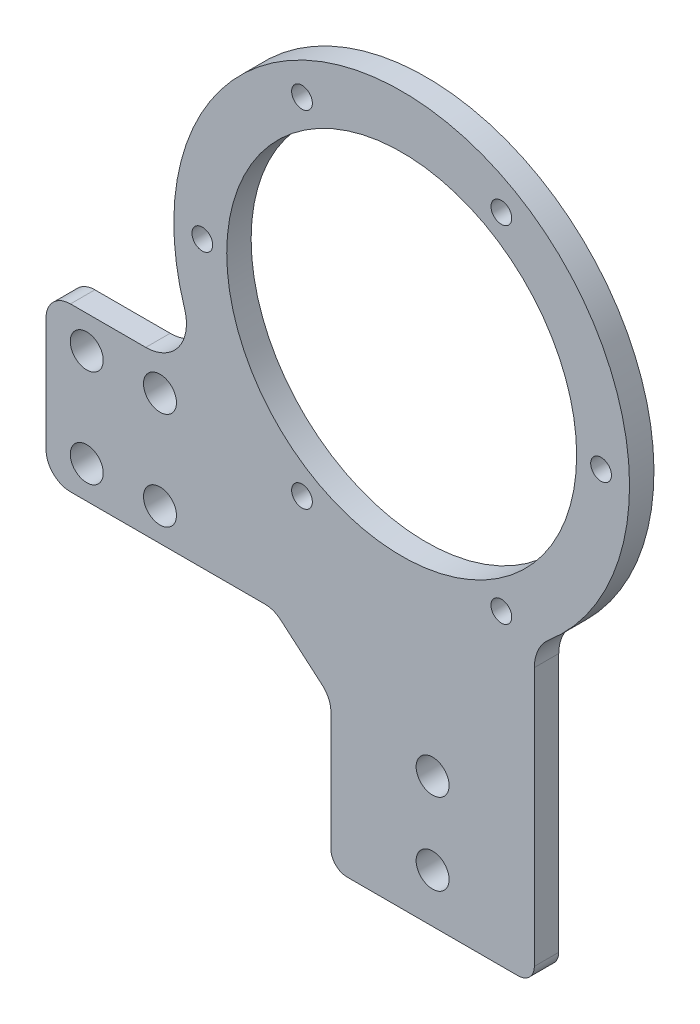
ISO-10303-21;
HEADER;
FILE_DESCRIPTION(('STEP AP214'),'2;1');
FILE_NAME('part.step','',(''),(''),'','','');
FILE_SCHEMA(('AUTOMOTIVE_DESIGN { 1 0 10303 214 1 1 1 1 }'));
ENDSEC;
DATA;
#1=APPLICATION_CONTEXT('core data for automotive mechanical design processes');
#2=APPLICATION_PROTOCOL_DEFINITION('international standard','automotive_design',2000,#1);
#3=PRODUCT_CONTEXT('',#1,'mechanical');
#4=PRODUCT('Part','Part','',(#3));
#5=PRODUCT_RELATED_PRODUCT_CATEGORY('part','',(#4));
#6=PRODUCT_DEFINITION_FORMATION('','',#4);
#7=PRODUCT_DEFINITION_CONTEXT('part definition',#1,'design');
#8=PRODUCT_DEFINITION('design','',#6,#7);
#9=PRODUCT_DEFINITION_SHAPE('','',#8);
#10=(LENGTH_UNIT() NAMED_UNIT(*) SI_UNIT(.MILLI.,.METRE.));
#11=(NAMED_UNIT(*) PLANE_ANGLE_UNIT() SI_UNIT($,.RADIAN.));
#12=(NAMED_UNIT(*) SI_UNIT($,.STERADIAN.) SOLID_ANGLE_UNIT());
#13=UNCERTAINTY_MEASURE_WITH_UNIT(LENGTH_MEASURE(1.E-05),#10,'distance_accuracy_value','');
#14=(GEOMETRIC_REPRESENTATION_CONTEXT(3) GLOBAL_UNCERTAINTY_ASSIGNED_CONTEXT((#13)) GLOBAL_UNIT_ASSIGNED_CONTEXT((#10,
#11,#12)) REPRESENTATION_CONTEXT('',''));
#15=CARTESIAN_POINT('',(0.,0.,0.));
#16=DIRECTION('',(0.,0.,1.));
#17=DIRECTION('',(1.,0.,0.));
#18=AXIS2_PLACEMENT_3D('',#15,#16,#17);
#19=CARTESIAN_POINT('',(-35.,20.,3.));
#20=DIRECTION('',(1.,0.,0.));
#21=DIRECTION('',(0.,1.,0.));
#22=AXIS2_PLACEMENT_3D('',#19,#20,#21);
#23=PLANE('',#22);
#24=DIRECTION('',(0.,-1.,0.));
#25=VECTOR('',#24,1.);
#26=CARTESIAN_POINT('',(-35.,20.,0.));
#27=LINE('',#26,#25);
#28=CARTESIAN_POINT('',(-35.,17.,0.));
#29=VERTEX_POINT('',#28);
#30=CARTESIAN_POINT('',(-35.,3.00000000000001,0.));
#31=VERTEX_POINT('',#30);
#32=EDGE_CURVE('E275',#29,#31,#27,.T.);
#33=ORIENTED_EDGE('',*,*,#32,.T.);
#34=DIRECTION('',(0.,0.,-1.));
#35=VECTOR('',#34,1.);
#36=CARTESIAN_POINT('',(-35.,3.00000000000001,3.));
#37=LINE('',#36,#35);
#38=CARTESIAN_POINT('',(-35.,3.00000000000001,3.));
#39=VERTEX_POINT('',#38);
#40=EDGE_CURVE('E231',#31,#39,#37,.F.);
#41=ORIENTED_EDGE('',*,*,#40,.T.);
#42=DIRECTION('',(0.,-1.,0.));
#43=VECTOR('',#42,1.);
#44=CARTESIAN_POINT('',(-35.,20.,3.));
#45=LINE('',#44,#43);
#46=CARTESIAN_POINT('',(-35.,17.,3.));
#47=VERTEX_POINT('',#46);
#48=EDGE_CURVE('E271',#47,#39,#45,.T.);
#49=ORIENTED_EDGE('',*,*,#48,.F.);
#50=DIRECTION('',(0.,0.,-1.));
#51=VECTOR('',#50,1.);
#52=CARTESIAN_POINT('',(-35.,17.,3.));
#53=LINE('',#52,#51);
#54=EDGE_CURVE('E228',#47,#29,#53,.T.);
#55=ORIENTED_EDGE('',*,*,#54,.T.);
#56=EDGE_LOOP('',(#33,#41,#49,#55));
#57=FACE_BOUND('',#56,.T.);
#58=ADVANCED_FACE('F35',(#57),#23,.F.);
#59=CARTESIAN_POINT('',(-35.,0.,3.));
#60=DIRECTION('',(0.,1.,0.));
#61=DIRECTION('',(0.,0.,1.));
#62=AXIS2_PLACEMENT_3D('',#59,#60,#61);
#63=PLANE('',#62);
#64=DIRECTION('',(1.,0.,0.));
#65=VECTOR('',#64,1.);
#66=CARTESIAN_POINT('',(-35.,0.,3.));
#67=LINE('',#66,#65);
#68=CARTESIAN_POINT('',(-32.,0.,3.));
#69=VERTEX_POINT('',#68);
#70=CARTESIAN_POINT('',(-8.10977222864644,0.,3.));
#71=VERTEX_POINT('',#70);
#72=EDGE_CURVE('E267',#69,#71,#67,.T.);
#73=ORIENTED_EDGE('',*,*,#72,.F.);
#74=DIRECTION('',(0.,0.,-1.));
#75=VECTOR('',#74,1.);
#76=CARTESIAN_POINT('',(-32.,0.,3.));
#77=LINE('',#76,#75);
#78=CARTESIAN_POINT('',(-32.,0.,0.));
#79=VERTEX_POINT('',#78);
#80=EDGE_CURVE('E221',#69,#79,#77,.T.);
#81=ORIENTED_EDGE('',*,*,#80,.T.);
#82=DIRECTION('',(1.,0.,0.));
#83=VECTOR('',#82,1.);
#84=CARTESIAN_POINT('',(-35.,0.,0.));
#85=LINE('',#84,#83);
#86=CARTESIAN_POINT('',(-8.10977222864644,0.,0.));
#87=VERTEX_POINT('',#86);
#88=EDGE_CURVE('E278',#79,#87,#85,.T.);
#89=ORIENTED_EDGE('',*,*,#88,.T.);
#90=DIRECTION('',(0.,0.,-1.));
#91=VECTOR('',#90,1.);
#92=CARTESIAN_POINT('',(-8.10977222864644,0.,3.));
#93=LINE('',#92,#91);
#94=EDGE_CURVE('E211',#87,#71,#93,.F.);
#95=ORIENTED_EDGE('',*,*,#94,.T.);
#96=EDGE_LOOP('',(#73,#81,#89,#95));
#97=FACE_BOUND('',#96,.T.);
#98=ADVANCED_FACE('F285',(#97),#63,.F.);
#99=CARTESIAN_POINT('',(0.,0.,3.));
#100=DIRECTION('',(1.,0.,0.));
#101=DIRECTION('',(0.,1.,0.));
#102=AXIS2_PLACEMENT_3D('',#99,#100,#101);
#103=PLANE('',#102);
#104=DIRECTION('',(0.,-1.,0.));
#105=VECTOR('',#104,1.);
#106=CARTESIAN_POINT('',(0.,0.,3.));
#107=LINE('',#106,#105);
#108=CARTESIAN_POINT('',(0.,-7.37980476741124,3.));
#109=VERTEX_POINT('',#108);
#110=CARTESIAN_POINT('',(0.,-22.,3.));
#111=VERTEX_POINT('',#110);
#112=EDGE_CURVE('E264',#109,#111,#107,.T.);
#113=ORIENTED_EDGE('',*,*,#112,.F.);
#114=DIRECTION('',(0.,0.,-1.));
#115=VECTOR('',#114,1.);
#116=CARTESIAN_POINT('',(0.,-7.37980476741124,3.));
#117=LINE('',#116,#115);
#118=CARTESIAN_POINT('',(0.,-7.37980476741124,0.));
#119=VERTEX_POINT('',#118);
#120=EDGE_CURVE('E243',#109,#119,#117,.T.);
#121=ORIENTED_EDGE('',*,*,#120,.T.);
#122=DIRECTION('',(0.,-1.,0.));
#123=VECTOR('',#122,1.);
#124=CARTESIAN_POINT('',(0.,0.,0.));
#125=LINE('',#124,#123);
#126=CARTESIAN_POINT('',(0.,-22.,0.));
#127=VERTEX_POINT('',#126);
#128=EDGE_CURVE('E160',#119,#127,#125,.T.);
#129=ORIENTED_EDGE('',*,*,#128,.T.);
#130=DIRECTION('',(0.,0.,-1.));
#131=VECTOR('',#130,1.);
#132=CARTESIAN_POINT('',(0.,-22.,3.));
#133=LINE('',#132,#131);
#134=EDGE_CURVE('E203',#127,#111,#133,.F.);
#135=ORIENTED_EDGE('',*,*,#134,.T.);
#136=EDGE_LOOP('',(#113,#121,#129,#135));
#137=FACE_BOUND('',#136,.T.);
#138=ADVANCED_FACE('F263',(#137),#103,.F.);
#139=CARTESIAN_POINT('',(25.,-30.,3.));
#140=DIRECTION('',(-1.,0.,0.));
#141=DIRECTION('',(0.,-1.,0.));
#142=AXIS2_PLACEMENT_3D('',#139,#140,#141);
#143=PLANE('',#142);
#144=DIRECTION('',(0.,1.,0.));
#145=VECTOR('',#144,1.);
#146=CARTESIAN_POINT('',(25.,-30.,3.));
#147=LINE('',#146,#145);
#148=CARTESIAN_POINT('',(25.,-22.,3.));
#149=VERTEX_POINT('',#148);
#150=CARTESIAN_POINT('',(25.,9.79464342644605,3.));
#151=VERTEX_POINT('',#150);
#152=EDGE_CURVE('E181',#149,#151,#147,.T.);
#153=ORIENTED_EDGE('',*,*,#152,.F.);
#154=DIRECTION('',(0.,0.,-1.));
#155=VECTOR('',#154,1.);
#156=CARTESIAN_POINT('',(25.,-22.,3.));
#157=LINE('',#156,#155);
#158=CARTESIAN_POINT('',(25.,-22.,0.));
#159=VERTEX_POINT('',#158);
#160=EDGE_CURVE('E157',#149,#159,#157,.T.);
#161=ORIENTED_EDGE('',*,*,#160,.T.);
#162=DIRECTION('',(0.,1.,0.));
#163=VECTOR('',#162,1.);
#164=CARTESIAN_POINT('',(25.,-30.,0.));
#165=LINE('',#164,#163);
#166=CARTESIAN_POINT('',(25.,9.79464342644605,0.));
#167=VERTEX_POINT('',#166);
#168=EDGE_CURVE('E150',#159,#167,#165,.T.);
#169=ORIENTED_EDGE('',*,*,#168,.T.);
#170=DIRECTION('',(0.,0.,-1.));
#171=VECTOR('',#170,1.);
#172=CARTESIAN_POINT('',(25.,9.79464342644605,3.));
#173=LINE('',#172,#171);
#174=EDGE_CURVE('E155',#167,#151,#173,.F.);
#175=ORIENTED_EDGE('',*,*,#174,.T.);
#176=EDGE_LOOP('',(#153,#161,#169,#175));
#177=FACE_BOUND('',#176,.T.);
#178=ADVANCED_FACE('F153',(#177),#143,.F.);
#179=CARTESIAN_POINT('',(25.,20.,3.));
#180=DIRECTION('',(0.,-1.,0.));
#181=DIRECTION('',(1.,0.,0.));
#182=AXIS2_PLACEMENT_3D('',#179,#180,#181);
#183=PLANE('',#182);
#184=DIRECTION('',(-1.,0.,0.));
#185=VECTOR('',#184,1.);
#186=CARTESIAN_POINT('',(25.,20.,0.));
#187=LINE('',#186,#185);
#188=CARTESIAN_POINT('',(-22.7483703870328,20.,0.));
#189=VERTEX_POINT('',#188);
#190=CARTESIAN_POINT('',(-32.,20.,0.));
#191=VERTEX_POINT('',#190);
#192=EDGE_CURVE('E159',#189,#191,#187,.T.);
#193=ORIENTED_EDGE('',*,*,#192,.T.);
#194=DIRECTION('',(0.,0.,-1.));
#195=VECTOR('',#194,1.);
#196=CARTESIAN_POINT('',(-32.,20.,3.));
#197=LINE('',#196,#195);
#198=CARTESIAN_POINT('',(-32.,20.,3.));
#199=VERTEX_POINT('',#198);
#200=EDGE_CURVE('E50',#191,#199,#197,.F.);
#201=ORIENTED_EDGE('',*,*,#200,.T.);
#202=DIRECTION('',(-1.,0.,0.));
#203=VECTOR('',#202,1.);
#204=CARTESIAN_POINT('',(25.,20.,3.));
#205=LINE('',#204,#203);
#206=CARTESIAN_POINT('',(-22.7483703870328,20.,3.));
#207=VERTEX_POINT('',#206);
#208=EDGE_CURVE('E177',#207,#199,#205,.T.);
#209=ORIENTED_EDGE('',*,*,#208,.F.);
#210=DIRECTION('',(0.,0.,-1.));
#211=VECTOR('',#210,1.);
#212=CARTESIAN_POINT('',(-22.7483703870328,20.,3.));
#213=LINE('',#212,#211);
#214=EDGE_CURVE('E186',#207,#189,#213,.T.);
#215=ORIENTED_EDGE('',*,*,#214,.T.);
#216=EDGE_LOOP('',(#193,#201,#209,#215));
#217=FACE_BOUND('',#216,.T.);
#218=ADVANCED_FACE('F376',(#217),#183,.F.);
#219=CARTESIAN_POINT('',(0.,0.,3.));
#220=DIRECTION('',(0.,0.,1.));
#221=DIRECTION('',(1.,0.,0.));
#222=AXIS2_PLACEMENT_3D('',#219,#220,#221);
#223=PLANE('',#222);
#224=CARTESIAN_POINT('',(-21.,4.,3.));
#225=DIRECTION('',(0.,0.,-1.));
#226=DIRECTION('',(-1.,0.,0.));
#227=AXIS2_PLACEMENT_3D('',#224,#225,#226);
#228=CIRCLE('',#227,2.025);
#229=CARTESIAN_POINT('',(-23.025,4.,3.));
#230=VERTEX_POINT('',#229);
#231=EDGE_CURVE('E299',#230,#230,#228,.T.);
#232=ORIENTED_EDGE('',*,*,#231,.T.);
#233=EDGE_LOOP('',(#232));
#234=FACE_BOUND('',#233,.T.);
#235=CARTESIAN_POINT('',(-21.,16.,3.));
#236=DIRECTION('',(0.,0.,-1.));
#237=DIRECTION('',(-1.,0.,0.));
#238=AXIS2_PLACEMENT_3D('',#235,#236,#237);
#239=CIRCLE('',#238,2.025);
#240=CARTESIAN_POINT('',(-23.025,16.,3.));
#241=VERTEX_POINT('',#240);
#242=EDGE_CURVE('E296',#241,#241,#239,.T.);
#243=ORIENTED_EDGE('',*,*,#242,.T.);
#244=EDGE_LOOP('',(#243));
#245=FACE_BOUND('',#244,.T.);
#246=CARTESIAN_POINT('',(-30.,16.,3.));
#247=DIRECTION('',(0.,0.,1.));
#248=DIRECTION('',(1.,0.,0.));
#249=AXIS2_PLACEMENT_3D('',#246,#247,#248);
#250=CIRCLE('',#249,2.025);
#251=CARTESIAN_POINT('',(-27.975,16.,3.));
#252=VERTEX_POINT('',#251);
#253=EDGE_CURVE('E216',#252,#252,#250,.T.);
#254=ORIENTED_EDGE('',*,*,#253,.F.);
#255=EDGE_LOOP('',(#254));
#256=FACE_BOUND('',#255,.T.);
#257=CARTESIAN_POINT('',(-30.,4.,3.));
#258=DIRECTION('',(0.,0.,1.));
#259=DIRECTION('',(1.,0.,0.));
#260=AXIS2_PLACEMENT_3D('',#257,#258,#259);
#261=CIRCLE('',#260,2.025);
#262=CARTESIAN_POINT('',(-27.975,4.,3.));
#263=VERTEX_POINT('',#262);
#264=EDGE_CURVE('E302',#263,#263,#261,.T.);
#265=ORIENTED_EDGE('',*,*,#264,.F.);
#266=EDGE_LOOP('',(#265));
#267=FACE_BOUND('',#266,.T.);
#268=ORIENTED_EDGE('',*,*,#48,.T.);
#269=CARTESIAN_POINT('',(-32.,3.,3.));
#270=DIRECTION('',(0.,0.,1.));
#271=DIRECTION('',(1.,0.,0.));
#272=AXIS2_PLACEMENT_3D('',#269,#270,#271);
#273=CIRCLE('',#272,3.);
#274=EDGE_CURVE('E235',#39,#69,#273,.T.);
#275=ORIENTED_EDGE('',*,*,#274,.T.);
#276=ORIENTED_EDGE('',*,*,#72,.T.);
#277=CARTESIAN_POINT('',(-8.10977222864644,-3.,3.));
#278=DIRECTION('',(0.,0.,1.));
#279=DIRECTION('',(1.,0.,0.));
#280=AXIS2_PLACEMENT_3D('',#277,#278,#279);
#281=CIRCLE('',#280,3.);
#282=CARTESIAN_POINT('',(-6.15739810827854,-0.722230192904112,3.));
#283=VERTEX_POINT('',#282);
#284=EDGE_CURVE('E248',#71,#283,#281,.F.);
#285=ORIENTED_EDGE('',*,*,#284,.T.);
#286=DIRECTION('',(-0.759256602365297,0.650791373455968,0.));
#287=VECTOR('',#286,1.);
#288=CARTESIAN_POINT('',(0.,-6.,3.));
#289=LINE('',#288,#287);
#290=CARTESIAN_POINT('',(-1.04762587963209,-5.10203496031535,3.));
#291=VERTEX_POINT('',#290);
#292=EDGE_CURVE('E260',#291,#283,#289,.T.);
#293=ORIENTED_EDGE('',*,*,#292,.F.);
#294=CARTESIAN_POINT('',(-3.,-7.37980476741124,3.));
#295=DIRECTION('',(0.,0.,1.));
#296=DIRECTION('',(1.,0.,0.));
#297=AXIS2_PLACEMENT_3D('',#294,#295,#296);
#298=CIRCLE('',#297,3.);
#299=EDGE_CURVE('E11',#291,#109,#298,.F.);
#300=ORIENTED_EDGE('',*,*,#299,.T.);
#301=ORIENTED_EDGE('',*,*,#112,.T.);
#302=CARTESIAN_POINT('',(2.00000000000001,-22.,3.));
#303=DIRECTION('',(0.,0.,1.));
#304=DIRECTION('',(1.,0.,0.));
#305=AXIS2_PLACEMENT_3D('',#302,#303,#304);
#306=CIRCLE('',#305,2.);
#307=CARTESIAN_POINT('',(2.00000000000001,-24.,3.));
#308=VERTEX_POINT('',#307);
#309=EDGE_CURVE('E208',#111,#308,#306,.T.);
#310=ORIENTED_EDGE('',*,*,#309,.T.);
#311=DIRECTION('',(1.,0.,0.));
#312=VECTOR('',#311,1.);
#313=CARTESIAN_POINT('',(25.,-24.,3.));
#314=LINE('',#313,#312);
#315=CARTESIAN_POINT('',(23.,-24.,3.));
#316=VERTEX_POINT('',#315);
#317=EDGE_CURVE('E312',#308,#316,#314,.T.);
#318=ORIENTED_EDGE('',*,*,#317,.T.);
#319=CARTESIAN_POINT('',(23.,-22.,3.));
#320=DIRECTION('',(0.,0.,1.));
#321=DIRECTION('',(1.,0.,0.));
#322=AXIS2_PLACEMENT_3D('',#319,#320,#321);
#323=CIRCLE('',#322,2.);
#324=EDGE_CURVE('E206',#316,#149,#323,.T.);
#325=ORIENTED_EDGE('',*,*,#324,.T.);
#326=ORIENTED_EDGE('',*,*,#152,.T.);
#327=CARTESIAN_POINT('',(30.,9.79464342644605,3.));
#328=DIRECTION('',(0.,0.,1.));
#329=DIRECTION('',(1.,0.,0.));
#330=AXIS2_PLACEMENT_3D('',#327,#328,#329);
#331=CIRCLE('',#330,5.);
#332=CARTESIAN_POINT('',(26.7727272727273,13.6136368466815,3.));
#333=VERTEX_POINT('',#332);
#334=EDGE_CURVE('E172',#151,#333,#331,.F.);
#335=ORIENTED_EDGE('',*,*,#334,.T.);
#336=CARTESIAN_POINT('',(8.7,35.,3.));
#337=DIRECTION('',(0.,0.,1.));
#338=DIRECTION('',(1.,0.,0.));
#339=AXIS2_PLACEMENT_3D('',#336,#337,#338);
#340=CIRCLE('',#339,28.);
#341=CARTESIAN_POINT('',(-17.9834657829369,26.5151515151515,3.));
#342=VERTEX_POINT('',#341);
#343=EDGE_CURVE('E279',#342,#333,#340,.F.);
#344=ORIENTED_EDGE('',*,*,#343,.F.);
#345=CARTESIAN_POINT('',(-22.7483703870328,25.,3.));
#346=DIRECTION('',(0.,0.,1.));
#347=DIRECTION('',(1.,0.,0.));
#348=AXIS2_PLACEMENT_3D('',#345,#346,#347);
#349=CIRCLE('',#348,5.);
#350=EDGE_CURVE('E191',#342,#207,#349,.F.);
#351=ORIENTED_EDGE('',*,*,#350,.T.);
#352=ORIENTED_EDGE('',*,*,#208,.T.);
#353=CARTESIAN_POINT('',(-32.,17.,3.));
#354=DIRECTION('',(0.,0.,1.));
#355=DIRECTION('',(1.,0.,0.));
#356=AXIS2_PLACEMENT_3D('',#353,#354,#355);
#357=CIRCLE('',#356,3.);
#358=EDGE_CURVE('E233',#199,#47,#357,.T.);
#359=ORIENTED_EDGE('',*,*,#358,.T.);
#360=EDGE_LOOP('',(#268,#275,#276,#285,#293,#300,#301,#310,#318,#325,#326,#335,#344,#351,#352,#359));
#361=FACE_BOUND('',#360,.T.);
#362=CARTESIAN_POINT('',(12.5,-8.,3.));
#363=DIRECTION('',(0.,0.,-1.));
#364=DIRECTION('',(-1.,0.,0.));
#365=AXIS2_PLACEMENT_3D('',#362,#363,#364);
#366=CIRCLE('',#365,2.025);
#367=CARTESIAN_POINT('',(10.475,-8.,3.));
#368=VERTEX_POINT('',#367);
#369=EDGE_CURVE('E318',#368,#368,#366,.T.);
#370=ORIENTED_EDGE('',*,*,#369,.T.);
#371=EDGE_LOOP('',(#370));
#372=FACE_BOUND('',#371,.T.);
#373=CARTESIAN_POINT('',(12.5,-18.,3.));
#374=DIRECTION('',(0.,0.,-1.));
#375=DIRECTION('',(-1.,0.,0.));
#376=AXIS2_PLACEMENT_3D('',#373,#374,#375);
#377=CIRCLE('',#376,2.025);
#378=CARTESIAN_POINT('',(10.475,-18.,3.));
#379=VERTEX_POINT('',#378);
#380=EDGE_CURVE('E325',#379,#379,#377,.T.);
#381=ORIENTED_EDGE('',*,*,#380,.T.);
#382=EDGE_LOOP('',(#381));
#383=FACE_BOUND('',#382,.T.);
#384=CARTESIAN_POINT('',(33.1999999999169,35.,3.));
#385=DIRECTION('',(0.,0.,-1.));
#386=DIRECTION('',(-1.,0.,0.));
#387=AXIS2_PLACEMENT_3D('',#384,#385,#386);
#388=CIRCLE('',#387,1.27499999977882);
#389=CARTESIAN_POINT('',(31.925000000138,35.,3.));
#390=VERTEX_POINT('',#389);
#391=EDGE_CURVE('E330',#390,#390,#388,.T.);
#392=ORIENTED_EDGE('',*,*,#391,.T.);
#393=EDGE_LOOP('',(#392));
#394=FACE_BOUND('',#393,.T.);
#395=CARTESIAN_POINT('',(20.9499999999587,13.7823776073534,3.));
#396=DIRECTION('',(0.,0.,-1.));
#397=DIRECTION('',(-1.,0.,0.));
#398=AXIS2_PLACEMENT_3D('',#395,#396,#397);
#399=CIRCLE('',#398,1.27499999977882);
#400=CARTESIAN_POINT('',(19.6750000001799,13.7823776073534,3.));
#401=VERTEX_POINT('',#400);
#402=EDGE_CURVE('E338',#401,#401,#399,.T.);
#403=ORIENTED_EDGE('',*,*,#402,.T.);
#404=EDGE_LOOP('',(#403));
#405=FACE_BOUND('',#404,.T.);
#406=CARTESIAN_POINT('',(-3.54999999995824,13.7823776073532,3.));
#407=DIRECTION('',(0.,0.,-1.));
#408=DIRECTION('',(-1.,0.,0.));
#409=AXIS2_PLACEMENT_3D('',#406,#407,#408);
#410=CIRCLE('',#409,1.27499999977882);
#411=CARTESIAN_POINT('',(-4.82499999973705,13.7823776073532,3.));
#412=VERTEX_POINT('',#411);
#413=EDGE_CURVE('E361',#412,#412,#410,.T.);
#414=ORIENTED_EDGE('',*,*,#413,.T.);
#415=EDGE_LOOP('',(#414));
#416=FACE_BOUND('',#415,.T.);
#417=CARTESIAN_POINT('',(-15.7999999999169,34.9999999999998,3.));
#418=DIRECTION('',(0.,0.,-1.));
#419=DIRECTION('',(-1.,0.,0.));
#420=AXIS2_PLACEMENT_3D('',#417,#418,#419);
#421=CIRCLE('',#420,1.27499999977882);
#422=CARTESIAN_POINT('',(-17.0749999996957,34.9999999999998,3.));
#423=VERTEX_POINT('',#422);
#424=EDGE_CURVE('E355',#423,#423,#421,.T.);
#425=ORIENTED_EDGE('',*,*,#424,.T.);
#426=EDGE_LOOP('',(#425));
#427=FACE_BOUND('',#426,.T.);
#428=CARTESIAN_POINT('',(-3.54999999995853,56.2176223926467,3.));
#429=DIRECTION('',(0.,0.,-1.));
#430=DIRECTION('',(-1.,0.,0.));
#431=AXIS2_PLACEMENT_3D('',#428,#429,#430);
#432=CIRCLE('',#431,1.27499999977882);
#433=CARTESIAN_POINT('',(-4.82499999973735,56.2176223926467,3.));
#434=VERTEX_POINT('',#433);
#435=EDGE_CURVE('E349',#434,#434,#432,.T.);
#436=ORIENTED_EDGE('',*,*,#435,.T.);
#437=EDGE_LOOP('',(#436));
#438=FACE_BOUND('',#437,.T.);
#439=CARTESIAN_POINT('',(20.9499999999584,56.2176223926468,3.));
#440=DIRECTION('',(0.,0.,-1.));
#441=DIRECTION('',(-1.,0.,0.));
#442=AXIS2_PLACEMENT_3D('',#439,#440,#441);
#443=CIRCLE('',#442,1.27499999977881);
#444=CARTESIAN_POINT('',(19.6750000001796,56.2176223926468,3.));
#445=VERTEX_POINT('',#444);
#446=EDGE_CURVE('E337',#445,#445,#443,.T.);
#447=ORIENTED_EDGE('',*,*,#446,.T.);
#448=EDGE_LOOP('',(#447));
#449=FACE_BOUND('',#448,.T.);
#450=CARTESIAN_POINT('',(8.7,35.,3.));
#451=DIRECTION('',(0.,0.,1.));
#452=DIRECTION('',(1.,0.,0.));
#453=AXIS2_PLACEMENT_3D('',#450,#451,#452);
#454=CIRCLE('',#453,21.5);
#455=CARTESIAN_POINT('',(30.2,35.,3.));
#456=VERTEX_POINT('',#455);
#457=EDGE_CURVE('E368',#456,#456,#454,.F.);
#458=ORIENTED_EDGE('',*,*,#457,.T.);
#459=EDGE_LOOP('',(#458));
#460=FACE_BOUND('',#459,.T.);
#461=ADVANCED_FACE('F291',(#234,#245,#256,#267,#361,#372,#383,#394,#405,#416,#427,#438,#449,
#460),#223,.T.);
#462=CARTESIAN_POINT('',(0.,0.,0.));
#463=DIRECTION('',(0.,0.,1.));
#464=DIRECTION('',(1.,0.,0.));
#465=AXIS2_PLACEMENT_3D('',#462,#463,#464);
#466=PLANE('',#465);
#467=CARTESIAN_POINT('',(-21.,4.,0.));
#468=DIRECTION('',(0.,0.,-1.));
#469=DIRECTION('',(-1.,0.,0.));
#470=AXIS2_PLACEMENT_3D('',#467,#468,#469);
#471=CIRCLE('',#470,2.025);
#472=CARTESIAN_POINT('',(-23.025,4.,0.));
#473=VERTEX_POINT('',#472);
#474=EDGE_CURVE('E303',#473,#473,#471,.T.);
#475=ORIENTED_EDGE('',*,*,#474,.F.);
#476=EDGE_LOOP('',(#475));
#477=FACE_BOUND('',#476,.T.);
#478=CARTESIAN_POINT('',(-21.,16.,0.));
#479=DIRECTION('',(0.,0.,-1.));
#480=DIRECTION('',(-1.,0.,0.));
#481=AXIS2_PLACEMENT_3D('',#478,#479,#480);
#482=CIRCLE('',#481,2.025);
#483=CARTESIAN_POINT('',(-23.025,16.,0.));
#484=VERTEX_POINT('',#483);
#485=EDGE_CURVE('E293',#484,#484,#482,.T.);
#486=ORIENTED_EDGE('',*,*,#485,.F.);
#487=EDGE_LOOP('',(#486));
#488=FACE_BOUND('',#487,.T.);
#489=CARTESIAN_POINT('',(-30.,16.,0.));
#490=DIRECTION('',(0.,0.,1.));
#491=DIRECTION('',(1.,0.,0.));
#492=AXIS2_PLACEMENT_3D('',#489,#490,#491);
#493=CIRCLE('',#492,2.025);
#494=CARTESIAN_POINT('',(-27.975,16.,0.));
#495=VERTEX_POINT('',#494);
#496=EDGE_CURVE('E215',#495,#495,#493,.T.);
#497=ORIENTED_EDGE('',*,*,#496,.T.);
#498=EDGE_LOOP('',(#497));
#499=FACE_BOUND('',#498,.T.);
#500=CARTESIAN_POINT('',(-30.,4.,0.));
#501=DIRECTION('',(0.,0.,1.));
#502=DIRECTION('',(1.,0.,0.));
#503=AXIS2_PLACEMENT_3D('',#500,#501,#502);
#504=CIRCLE('',#503,2.025);
#505=CARTESIAN_POINT('',(-27.975,4.,0.));
#506=VERTEX_POINT('',#505);
#507=EDGE_CURVE('E212',#506,#506,#504,.T.);
#508=ORIENTED_EDGE('',*,*,#507,.T.);
#509=EDGE_LOOP('',(#508));
#510=FACE_BOUND('',#509,.T.);
#511=CARTESIAN_POINT('',(12.5,-8.,0.));
#512=DIRECTION('',(0.,0.,-1.));
#513=DIRECTION('',(-1.,0.,0.));
#514=AXIS2_PLACEMENT_3D('',#511,#512,#513);
#515=CIRCLE('',#514,2.025);
#516=CARTESIAN_POINT('',(10.475,-8.,0.));
#517=VERTEX_POINT('',#516);
#518=EDGE_CURVE('E322',#517,#517,#515,.T.);
#519=ORIENTED_EDGE('',*,*,#518,.F.);
#520=EDGE_LOOP('',(#519));
#521=FACE_BOUND('',#520,.T.);
#522=CARTESIAN_POINT('',(12.5,-18.,0.));
#523=DIRECTION('',(0.,0.,-1.));
#524=DIRECTION('',(-1.,0.,0.));
#525=AXIS2_PLACEMENT_3D('',#522,#523,#524);
#526=CIRCLE('',#525,2.025);
#527=CARTESIAN_POINT('',(10.475,-18.,0.));
#528=VERTEX_POINT('',#527);
#529=EDGE_CURVE('E315',#528,#528,#526,.T.);
#530=ORIENTED_EDGE('',*,*,#529,.F.);
#531=EDGE_LOOP('',(#530));
#532=FACE_BOUND('',#531,.T.);
#533=CARTESIAN_POINT('',(33.1999999999169,35.,0.));
#534=DIRECTION('',(0.,0.,-1.));
#535=DIRECTION('',(-1.,0.,0.));
#536=AXIS2_PLACEMENT_3D('',#533,#534,#535);
#537=CIRCLE('',#536,1.27499999977882);
#538=CARTESIAN_POINT('',(31.925000000138,35.,0.));
#539=VERTEX_POINT('',#538);
#540=EDGE_CURVE('E334',#539,#539,#537,.T.);
#541=ORIENTED_EDGE('',*,*,#540,.F.);
#542=EDGE_LOOP('',(#541));
#543=FACE_BOUND('',#542,.T.);
#544=CARTESIAN_POINT('',(20.9499999999587,13.7823776073534,0.));
#545=DIRECTION('',(0.,0.,-1.));
#546=DIRECTION('',(-1.,0.,0.));
#547=AXIS2_PLACEMENT_3D('',#544,#545,#546);
#548=CIRCLE('',#547,1.27499999977882);
#549=CARTESIAN_POINT('',(19.6750000001799,13.7823776073534,0.));
#550=VERTEX_POINT('',#549);
#551=EDGE_CURVE('E321',#550,#550,#548,.T.);
#552=ORIENTED_EDGE('',*,*,#551,.F.);
#553=EDGE_LOOP('',(#552));
#554=FACE_BOUND('',#553,.T.);
#555=CARTESIAN_POINT('',(-3.54999999995824,13.7823776073532,0.));
#556=DIRECTION('',(0.,0.,-1.));
#557=DIRECTION('',(-1.,0.,0.));
#558=AXIS2_PLACEMENT_3D('',#555,#556,#557);
#559=CIRCLE('',#558,1.27499999977882);
#560=CARTESIAN_POINT('',(-4.82499999973705,13.7823776073532,0.));
#561=VERTEX_POINT('',#560);
#562=EDGE_CURVE('E341',#561,#561,#559,.T.);
#563=ORIENTED_EDGE('',*,*,#562,.F.);
#564=EDGE_LOOP('',(#563));
#565=FACE_BOUND('',#564,.T.);
#566=CARTESIAN_POINT('',(-15.7999999999169,34.9999999999998,0.));
#567=DIRECTION('',(0.,0.,-1.));
#568=DIRECTION('',(-1.,0.,0.));
#569=AXIS2_PLACEMENT_3D('',#566,#567,#568);
#570=CIRCLE('',#569,1.27499999977882);
#571=CARTESIAN_POINT('',(-17.0749999996957,34.9999999999998,0.));
#572=VERTEX_POINT('',#571);
#573=EDGE_CURVE('E358',#572,#572,#570,.T.);
#574=ORIENTED_EDGE('',*,*,#573,.F.);
#575=EDGE_LOOP('',(#574));
#576=FACE_BOUND('',#575,.T.);
#577=CARTESIAN_POINT('',(-3.54999999995853,56.2176223926467,0.));
#578=DIRECTION('',(0.,0.,-1.));
#579=DIRECTION('',(-1.,0.,0.));
#580=AXIS2_PLACEMENT_3D('',#577,#578,#579);
#581=CIRCLE('',#580,1.27499999977882);
#582=CARTESIAN_POINT('',(-4.82499999973735,56.2176223926467,0.));
#583=VERTEX_POINT('',#582);
#584=EDGE_CURVE('E352',#583,#583,#581,.T.);
#585=ORIENTED_EDGE('',*,*,#584,.F.);
#586=EDGE_LOOP('',(#585));
#587=FACE_BOUND('',#586,.T.);
#588=CARTESIAN_POINT('',(20.9499999999584,56.2176223926468,0.));
#589=DIRECTION('',(0.,0.,-1.));
#590=DIRECTION('',(-1.,0.,0.));
#591=AXIS2_PLACEMENT_3D('',#588,#589,#590);
#592=CIRCLE('',#591,1.27499999977881);
#593=CARTESIAN_POINT('',(19.6750000001796,56.2176223926468,0.));
#594=VERTEX_POINT('',#593);
#595=EDGE_CURVE('E346',#594,#594,#592,.T.);
#596=ORIENTED_EDGE('',*,*,#595,.F.);
#597=EDGE_LOOP('',(#596));
#598=FACE_BOUND('',#597,.T.);
#599=CARTESIAN_POINT('',(8.7,35.,0.));
#600=DIRECTION('',(0.,0.,-1.));
#601=DIRECTION('',(-1.,0.,0.));
#602=AXIS2_PLACEMENT_3D('',#599,#600,#601);
#603=CIRCLE('',#602,21.5);
#604=CARTESIAN_POINT('',(-12.8,35.,0.));
#605=VERTEX_POINT('',#604);
#606=EDGE_CURVE('E333',#605,#605,#603,.T.);
#607=ORIENTED_EDGE('',*,*,#606,.F.);
#608=EDGE_LOOP('',(#607));
#609=FACE_BOUND('',#608,.T.);
#610=ORIENTED_EDGE('',*,*,#88,.F.);
#611=CARTESIAN_POINT('',(-32.,3.,0.));
#612=DIRECTION('',(0.,0.,1.));
#613=DIRECTION('',(1.,0.,0.));
#614=AXIS2_PLACEMENT_3D('',#611,#612,#613);
#615=CIRCLE('',#614,3.);
#616=EDGE_CURVE('E226',#79,#31,#615,.F.);
#617=ORIENTED_EDGE('',*,*,#616,.T.);
#618=ORIENTED_EDGE('',*,*,#32,.F.);
#619=CARTESIAN_POINT('',(-32.,17.,0.));
#620=DIRECTION('',(0.,0.,1.));
#621=DIRECTION('',(1.,0.,0.));
#622=AXIS2_PLACEMENT_3D('',#619,#620,#621);
#623=CIRCLE('',#622,3.);
#624=EDGE_CURVE('E224',#29,#191,#623,.F.);
#625=ORIENTED_EDGE('',*,*,#624,.T.);
#626=ORIENTED_EDGE('',*,*,#192,.F.);
#627=CARTESIAN_POINT('',(-22.7483703870328,25.,0.));
#628=DIRECTION('',(0.,0.,1.));
#629=DIRECTION('',(1.,0.,0.));
#630=AXIS2_PLACEMENT_3D('',#627,#628,#629);
#631=CIRCLE('',#630,5.);
#632=CARTESIAN_POINT('',(-17.9834657829369,26.5151515151515,0.));
#633=VERTEX_POINT('',#632);
#634=EDGE_CURVE('E171',#189,#633,#631,.T.);
#635=ORIENTED_EDGE('',*,*,#634,.T.);
#636=CARTESIAN_POINT('',(8.7,35.,0.));
#637=DIRECTION('',(0.,0.,-1.));
#638=DIRECTION('',(-1.,0.,0.));
#639=AXIS2_PLACEMENT_3D('',#636,#637,#638);
#640=CIRCLE('',#639,28.);
#641=CARTESIAN_POINT('',(26.7727272727273,13.6136368466815,0.));
#642=VERTEX_POINT('',#641);
#643=EDGE_CURVE('E168',#633,#642,#640,.T.);
#644=ORIENTED_EDGE('',*,*,#643,.T.);
#645=CARTESIAN_POINT('',(30.,9.79464342644605,0.));
#646=DIRECTION('',(0.,0.,1.));
#647=DIRECTION('',(1.,0.,0.));
#648=AXIS2_PLACEMENT_3D('',#645,#646,#647);
#649=CIRCLE('',#648,5.);
#650=EDGE_CURVE('E164',#642,#167,#649,.T.);
#651=ORIENTED_EDGE('',*,*,#650,.T.);
#652=ORIENTED_EDGE('',*,*,#168,.F.);
#653=CARTESIAN_POINT('',(23.,-22.,0.));
#654=DIRECTION('',(0.,0.,1.));
#655=DIRECTION('',(1.,0.,0.));
#656=AXIS2_PLACEMENT_3D('',#653,#654,#655);
#657=CIRCLE('',#656,2.);
#658=CARTESIAN_POINT('',(23.,-24.,0.));
#659=VERTEX_POINT('',#658);
#660=EDGE_CURVE('E198',#159,#659,#657,.F.);
#661=ORIENTED_EDGE('',*,*,#660,.T.);
#662=DIRECTION('',(1.,0.,0.));
#663=VECTOR('',#662,1.);
#664=CARTESIAN_POINT('',(25.,-24.,0.));
#665=LINE('',#664,#663);
#666=CARTESIAN_POINT('',(2.00000000000001,-24.,0.));
#667=VERTEX_POINT('',#666);
#668=EDGE_CURVE('E219',#667,#659,#665,.T.);
#669=ORIENTED_EDGE('',*,*,#668,.F.);
#670=CARTESIAN_POINT('',(2.00000000000001,-22.,0.));
#671=DIRECTION('',(0.,0.,1.));
#672=DIRECTION('',(1.,0.,0.));
#673=AXIS2_PLACEMENT_3D('',#670,#671,#672);
#674=CIRCLE('',#673,2.);
#675=EDGE_CURVE('E200',#667,#127,#674,.F.);
#676=ORIENTED_EDGE('',*,*,#675,.T.);
#677=ORIENTED_EDGE('',*,*,#128,.F.);
#678=CARTESIAN_POINT('',(-3.,-7.37980476741124,0.));
#679=DIRECTION('',(0.,0.,1.));
#680=DIRECTION('',(1.,0.,0.));
#681=AXIS2_PLACEMENT_3D('',#678,#679,#680);
#682=CIRCLE('',#681,3.);
#683=CARTESIAN_POINT('',(-1.04762587963209,-5.10203496031535,0.));
#684=VERTEX_POINT('',#683);
#685=EDGE_CURVE('E43',#119,#684,#682,.T.);
#686=ORIENTED_EDGE('',*,*,#685,.T.);
#687=DIRECTION('',(-0.759256602365296,0.650791373455968,0.));
#688=VECTOR('',#687,1.);
#689=CARTESIAN_POINT('',(0.,-6.,0.));
#690=LINE('',#689,#688);
#691=CARTESIAN_POINT('',(-6.15739810827854,-0.722230192904112,0.));
#692=VERTEX_POINT('',#691);
#693=EDGE_CURVE('E252',#684,#692,#690,.T.);
#694=ORIENTED_EDGE('',*,*,#693,.T.);
#695=CARTESIAN_POINT('',(-8.10977222864644,-3.,0.));
#696=DIRECTION('',(0.,0.,1.));
#697=DIRECTION('',(1.,0.,0.));
#698=AXIS2_PLACEMENT_3D('',#695,#696,#697);
#699=CIRCLE('',#698,3.);
#700=EDGE_CURVE('E246',#692,#87,#699,.T.);
#701=ORIENTED_EDGE('',*,*,#700,.T.);
#702=EDGE_LOOP('',(#610,#617,#618,#625,#626,#635,#644,#651,#652,#661,#669,#676,#677,#686,#694,#701));
#703=FACE_BOUND('',#702,.T.);
#704=ADVANCED_FACE('F166',(#477,#488,#499,#510,#521,#532,#543,#554,#565,#576,#587,#598,#609,
#703),#466,.F.);
#705=CARTESIAN_POINT('',(8.7,35.,82.1959594928933));
#706=DIRECTION('',(0.,0.,-1.));
#707=DIRECTION('',(-1.,0.,0.));
#708=AXIS2_PLACEMENT_3D('',#705,#706,#707);
#709=CYLINDRICAL_SURFACE('',#708,28.);
#710=ORIENTED_EDGE('',*,*,#343,.T.);
#711=DIRECTION('',(0.,0.,-1.));
#712=VECTOR('',#711,1.);
#713=CARTESIAN_POINT('',(26.7727272727273,13.6136368466815,82.1959594928933));
#714=LINE('',#713,#712);
#715=EDGE_CURVE('E179',#333,#642,#714,.T.);
#716=ORIENTED_EDGE('',*,*,#715,.T.);
#717=ORIENTED_EDGE('',*,*,#643,.F.);
#718=DIRECTION('',(0.,0.,-1.));
#719=VECTOR('',#718,1.);
#720=CARTESIAN_POINT('',(-17.9834657829369,26.5151515151515,82.1959594928933));
#721=LINE('',#720,#719);
#722=EDGE_CURVE('E176',#633,#342,#721,.F.);
#723=ORIENTED_EDGE('',*,*,#722,.T.);
#724=EDGE_LOOP('',(#710,#716,#717,#723));
#725=FACE_BOUND('',#724,.T.);
#726=ADVANCED_FACE('F472',(#725),#709,.T.);
#727=CARTESIAN_POINT('',(8.7,35.,63.8111831820431));
#728=DIRECTION('',(0.,0.,-1.));
#729=DIRECTION('',(-1.,0.,0.));
#730=AXIS2_PLACEMENT_3D('',#727,#728,#729);
#731=CYLINDRICAL_SURFACE('',#730,21.5);
#732=ORIENTED_EDGE('',*,*,#606,.T.);
#733=EDGE_LOOP('',(#732));
#734=FACE_BOUND('',#733,.T.);
#735=ORIENTED_EDGE('',*,*,#457,.F.);
#736=EDGE_LOOP('',(#735));
#737=FACE_BOUND('',#736,.T.);
#738=ADVANCED_FACE('F408',(#734,#737),#731,.F.);
#739=CARTESIAN_POINT('',(30.,9.79464342644605,82.1959594928933));
#740=DIRECTION('',(0.,0.,-1.));
#741=DIRECTION('',(-1.,0.,0.));
#742=AXIS2_PLACEMENT_3D('',#739,#740,#741);
#743=CYLINDRICAL_SURFACE('',#742,5.);
#744=ORIENTED_EDGE('',*,*,#650,.F.);
#745=ORIENTED_EDGE('',*,*,#715,.F.);
#746=ORIENTED_EDGE('',*,*,#334,.F.);
#747=ORIENTED_EDGE('',*,*,#174,.F.);
#748=EDGE_LOOP('',(#744,#745,#746,#747));
#749=FACE_BOUND('',#748,.T.);
#750=ADVANCED_FACE('F175',(#749),#743,.F.);
#751=CARTESIAN_POINT('',(-22.7483703870328,25.,82.1959594928933));
#752=DIRECTION('',(0.,0.,-1.));
#753=DIRECTION('',(-1.,0.,0.));
#754=AXIS2_PLACEMENT_3D('',#751,#752,#753);
#755=CYLINDRICAL_SURFACE('',#754,5.);
#756=ORIENTED_EDGE('',*,*,#350,.F.);
#757=ORIENTED_EDGE('',*,*,#722,.F.);
#758=ORIENTED_EDGE('',*,*,#634,.F.);
#759=ORIENTED_EDGE('',*,*,#214,.F.);
#760=EDGE_LOOP('',(#756,#757,#758,#759));
#761=FACE_BOUND('',#760,.T.);
#762=ADVANCED_FACE('F407',(#761),#755,.F.);
#763=CARTESIAN_POINT('',(20.9499999999584,56.2176223926468,3.));
#764=DIRECTION('',(0.,0.,-1.));
#765=DIRECTION('',(-1.,0.,0.));
#766=AXIS2_PLACEMENT_3D('',#763,#764,#765);
#767=CYLINDRICAL_SURFACE('',#766,1.27499999977881);
#768=ORIENTED_EDGE('',*,*,#446,.F.);
#769=EDGE_LOOP('',(#768));
#770=FACE_BOUND('',#769,.T.);
#771=ORIENTED_EDGE('',*,*,#595,.T.);
#772=EDGE_LOOP('',(#771));
#773=FACE_BOUND('',#772,.T.);
#774=ADVANCED_FACE('F411',(#770,#773),#767,.F.);
#775=CARTESIAN_POINT('',(-3.54999999995853,56.2176223926467,3.));
#776=DIRECTION('',(0.,0.,-1.));
#777=DIRECTION('',(-1.,0.,0.));
#778=AXIS2_PLACEMENT_3D('',#775,#776,#777);
#779=CYLINDRICAL_SURFACE('',#778,1.27499999977882);
#780=ORIENTED_EDGE('',*,*,#435,.F.);
#781=EDGE_LOOP('',(#780));
#782=FACE_BOUND('',#781,.T.);
#783=ORIENTED_EDGE('',*,*,#584,.T.);
#784=EDGE_LOOP('',(#783));
#785=FACE_BOUND('',#784,.T.);
#786=ADVANCED_FACE('F458',(#782,#785),#779,.F.);
#787=CARTESIAN_POINT('',(-15.7999999999169,34.9999999999998,3.));
#788=DIRECTION('',(0.,0.,-1.));
#789=DIRECTION('',(-1.,0.,0.));
#790=AXIS2_PLACEMENT_3D('',#787,#788,#789);
#791=CYLINDRICAL_SURFACE('',#790,1.27499999977882);
#792=ORIENTED_EDGE('',*,*,#424,.F.);
#793=EDGE_LOOP('',(#792));
#794=FACE_BOUND('',#793,.T.);
#795=ORIENTED_EDGE('',*,*,#573,.T.);
#796=EDGE_LOOP('',(#795));
#797=FACE_BOUND('',#796,.T.);
#798=ADVANCED_FACE('F462',(#794,#797),#791,.F.);
#799=CARTESIAN_POINT('',(-3.54999999995824,13.7823776073532,3.));
#800=DIRECTION('',(0.,0.,-1.));
#801=DIRECTION('',(-1.,0.,0.));
#802=AXIS2_PLACEMENT_3D('',#799,#800,#801);
#803=CYLINDRICAL_SURFACE('',#802,1.27499999977882);
#804=ORIENTED_EDGE('',*,*,#413,.F.);
#805=EDGE_LOOP('',(#804));
#806=FACE_BOUND('',#805,.T.);
#807=ORIENTED_EDGE('',*,*,#562,.T.);
#808=EDGE_LOOP('',(#807));
#809=FACE_BOUND('',#808,.T.);
#810=ADVANCED_FACE('F454',(#806,#809),#803,.F.);
#811=CARTESIAN_POINT('',(20.9499999999587,13.7823776073534,3.));
#812=DIRECTION('',(0.,0.,-1.));
#813=DIRECTION('',(-1.,0.,0.));
#814=AXIS2_PLACEMENT_3D('',#811,#812,#813);
#815=CYLINDRICAL_SURFACE('',#814,1.27499999977882);
#816=ORIENTED_EDGE('',*,*,#402,.F.);
#817=EDGE_LOOP('',(#816));
#818=FACE_BOUND('',#817,.T.);
#819=ORIENTED_EDGE('',*,*,#551,.T.);
#820=EDGE_LOOP('',(#819));
#821=FACE_BOUND('',#820,.T.);
#822=ADVANCED_FACE('F450',(#818,#821),#815,.F.);
#823=CARTESIAN_POINT('',(33.1999999999169,35.,3.));
#824=DIRECTION('',(0.,0.,-1.));
#825=DIRECTION('',(-1.,0.,0.));
#826=AXIS2_PLACEMENT_3D('',#823,#824,#825);
#827=CYLINDRICAL_SURFACE('',#826,1.27499999977882);
#828=ORIENTED_EDGE('',*,*,#391,.F.);
#829=EDGE_LOOP('',(#828));
#830=FACE_BOUND('',#829,.T.);
#831=ORIENTED_EDGE('',*,*,#540,.T.);
#832=EDGE_LOOP('',(#831));
#833=FACE_BOUND('',#832,.T.);
#834=ADVANCED_FACE('F446',(#830,#833),#827,.F.);
#835=CARTESIAN_POINT('',(12.5,-18.,3.));
#836=DIRECTION('',(0.,0.,-1.));
#837=DIRECTION('',(-1.,0.,0.));
#838=AXIS2_PLACEMENT_3D('',#835,#836,#837);
#839=CYLINDRICAL_SURFACE('',#838,2.025);
#840=ORIENTED_EDGE('',*,*,#380,.F.);
#841=EDGE_LOOP('',(#840));
#842=FACE_BOUND('',#841,.T.);
#843=ORIENTED_EDGE('',*,*,#529,.T.);
#844=EDGE_LOOP('',(#843));
#845=FACE_BOUND('',#844,.T.);
#846=ADVANCED_FACE('F439',(#842,#845),#839,.F.);
#847=CARTESIAN_POINT('',(12.5,-8.,3.));
#848=DIRECTION('',(0.,0.,-1.));
#849=DIRECTION('',(-1.,0.,0.));
#850=AXIS2_PLACEMENT_3D('',#847,#848,#849);
#851=CYLINDRICAL_SURFACE('',#850,2.025);
#852=ORIENTED_EDGE('',*,*,#369,.F.);
#853=EDGE_LOOP('',(#852));
#854=FACE_BOUND('',#853,.T.);
#855=ORIENTED_EDGE('',*,*,#518,.T.);
#856=EDGE_LOOP('',(#855));
#857=FACE_BOUND('',#856,.T.);
#858=ADVANCED_FACE('F434',(#854,#857),#851,.F.);
#859=CARTESIAN_POINT('',(25.,-24.,3.));
#860=DIRECTION('',(0.,1.,0.));
#861=DIRECTION('',(0.,0.,1.));
#862=AXIS2_PLACEMENT_3D('',#859,#860,#861);
#863=PLANE('',#862);
#864=ORIENTED_EDGE('',*,*,#317,.F.);
#865=DIRECTION('',(0.,0.,-1.));
#866=VECTOR('',#865,1.);
#867=CARTESIAN_POINT('',(2.00000000000001,-24.,3.));
#868=LINE('',#867,#866);
#869=EDGE_CURVE('E195',#308,#667,#868,.T.);
#870=ORIENTED_EDGE('',*,*,#869,.T.);
#871=ORIENTED_EDGE('',*,*,#668,.T.);
#872=DIRECTION('',(0.,0.,-1.));
#873=VECTOR('',#872,1.);
#874=CARTESIAN_POINT('',(23.,-24.,3.));
#875=LINE('',#874,#873);
#876=EDGE_CURVE('E193',#659,#316,#875,.F.);
#877=ORIENTED_EDGE('',*,*,#876,.T.);
#878=EDGE_LOOP('',(#864,#870,#871,#877));
#879=FACE_BOUND('',#878,.T.);
#880=ADVANCED_FACE('F416',(#879),#863,.F.);
#881=CARTESIAN_POINT('',(2.00000000000001,-22.,3.));
#882=DIRECTION('',(0.,0.,-1.));
#883=DIRECTION('',(-1.,0.,0.));
#884=AXIS2_PLACEMENT_3D('',#881,#882,#883);
#885=CYLINDRICAL_SURFACE('',#884,2.);
#886=ORIENTED_EDGE('',*,*,#309,.F.);
#887=ORIENTED_EDGE('',*,*,#134,.F.);
#888=ORIENTED_EDGE('',*,*,#675,.F.);
#889=ORIENTED_EDGE('',*,*,#869,.F.);
#890=EDGE_LOOP('',(#886,#887,#888,#889));
#891=FACE_BOUND('',#890,.T.);
#892=ADVANCED_FACE('F413',(#891),#885,.T.);
#893=CARTESIAN_POINT('',(23.,-22.,3.));
#894=DIRECTION('',(0.,0.,-1.));
#895=DIRECTION('',(-1.,0.,0.));
#896=AXIS2_PLACEMENT_3D('',#893,#894,#895);
#897=CYLINDRICAL_SURFACE('',#896,2.);
#898=ORIENTED_EDGE('',*,*,#324,.F.);
#899=ORIENTED_EDGE('',*,*,#876,.F.);
#900=ORIENTED_EDGE('',*,*,#660,.F.);
#901=ORIENTED_EDGE('',*,*,#160,.F.);
#902=EDGE_LOOP('',(#898,#899,#900,#901));
#903=FACE_BOUND('',#902,.T.);
#904=ADVANCED_FACE('F415',(#903),#897,.T.);
#905=CARTESIAN_POINT('',(-30.,4.,-7.));
#906=DIRECTION('',(0.,0.,1.));
#907=DIRECTION('',(1.,0.,0.));
#908=AXIS2_PLACEMENT_3D('',#905,#906,#907);
#909=CYLINDRICAL_SURFACE('',#908,2.025);
#910=ORIENTED_EDGE('',*,*,#264,.T.);
#911=EDGE_LOOP('',(#910));
#912=FACE_BOUND('',#911,.T.);
#913=ORIENTED_EDGE('',*,*,#507,.F.);
#914=EDGE_LOOP('',(#913));
#915=FACE_BOUND('',#914,.T.);
#916=ADVANCED_FACE('F419',(#912,#915),#909,.F.);
#917=CARTESIAN_POINT('',(-30.,16.,-7.));
#918=DIRECTION('',(0.,0.,1.));
#919=DIRECTION('',(1.,0.,0.));
#920=AXIS2_PLACEMENT_3D('',#917,#918,#919);
#921=CYLINDRICAL_SURFACE('',#920,2.025);
#922=ORIENTED_EDGE('',*,*,#253,.T.);
#923=EDGE_LOOP('',(#922));
#924=FACE_BOUND('',#923,.T.);
#925=ORIENTED_EDGE('',*,*,#496,.F.);
#926=EDGE_LOOP('',(#925));
#927=FACE_BOUND('',#926,.T.);
#928=ADVANCED_FACE('F424',(#924,#927),#921,.F.);
#929=CARTESIAN_POINT('',(-21.,16.,3.));
#930=DIRECTION('',(0.,0.,-1.));
#931=DIRECTION('',(-1.,0.,0.));
#932=AXIS2_PLACEMENT_3D('',#929,#930,#931);
#933=CYLINDRICAL_SURFACE('',#932,2.025);
#934=ORIENTED_EDGE('',*,*,#242,.F.);
#935=EDGE_LOOP('',(#934));
#936=FACE_BOUND('',#935,.T.);
#937=ORIENTED_EDGE('',*,*,#485,.T.);
#938=EDGE_LOOP('',(#937));
#939=FACE_BOUND('',#938,.T.);
#940=ADVANCED_FACE('F586',(#936,#939),#933,.F.);
#941=CARTESIAN_POINT('',(-21.,4.,3.));
#942=DIRECTION('',(0.,0.,-1.));
#943=DIRECTION('',(-1.,0.,0.));
#944=AXIS2_PLACEMENT_3D('',#941,#942,#943);
#945=CYLINDRICAL_SURFACE('',#944,2.025);
#946=ORIENTED_EDGE('',*,*,#231,.F.);
#947=EDGE_LOOP('',(#946));
#948=FACE_BOUND('',#947,.T.);
#949=ORIENTED_EDGE('',*,*,#474,.T.);
#950=EDGE_LOOP('',(#949));
#951=FACE_BOUND('',#950,.T.);
#952=ADVANCED_FACE('F394',(#948,#951),#945,.F.);
#953=CARTESIAN_POINT('',(0.,-6.,12.2195444572929));
#954=DIRECTION('',(-0.650791373455968,-0.759256602365297,0.));
#955=DIRECTION('',(0.759256602365297,-0.650791373455968,0.));
#956=AXIS2_PLACEMENT_3D('',#953,#954,#955);
#957=PLANE('',#956);
#958=ORIENTED_EDGE('',*,*,#292,.T.);
#959=DIRECTION('',(0.,0.,-1.));
#960=VECTOR('',#959,1.);
#961=CARTESIAN_POINT('',(-6.15739810827854,-0.722230192904112,12.2195444572929));
#962=LINE('',#961,#960);
#963=EDGE_CURVE('E240',#283,#692,#962,.T.);
#964=ORIENTED_EDGE('',*,*,#963,.T.);
#965=ORIENTED_EDGE('',*,*,#693,.F.);
#966=DIRECTION('',(0.,0.,-1.));
#967=VECTOR('',#966,1.);
#968=CARTESIAN_POINT('',(-1.04762587963209,-5.10203496031535,12.2195444572929));
#969=LINE('',#968,#967);
#970=EDGE_CURVE('E238',#684,#291,#969,.F.);
#971=ORIENTED_EDGE('',*,*,#970,.T.);
#972=EDGE_LOOP('',(#958,#964,#965,#971));
#973=FACE_BOUND('',#972,.T.);
#974=ADVANCED_FACE('F258',(#973),#957,.T.);
#975=CARTESIAN_POINT('',(-32.,3.,3.));
#976=DIRECTION('',(0.,0.,-1.));
#977=DIRECTION('',(-1.,0.,0.));
#978=AXIS2_PLACEMENT_3D('',#975,#976,#977);
#979=CYLINDRICAL_SURFACE('',#978,3.);
#980=ORIENTED_EDGE('',*,*,#274,.F.);
#981=ORIENTED_EDGE('',*,*,#40,.F.);
#982=ORIENTED_EDGE('',*,*,#616,.F.);
#983=ORIENTED_EDGE('',*,*,#80,.F.);
#984=EDGE_LOOP('',(#980,#981,#982,#983));
#985=FACE_BOUND('',#984,.T.);
#986=ADVANCED_FACE('F386',(#985),#979,.T.);
#987=CARTESIAN_POINT('',(-32.,17.,3.));
#988=DIRECTION('',(0.,0.,-1.));
#989=DIRECTION('',(-1.,0.,0.));
#990=AXIS2_PLACEMENT_3D('',#987,#988,#989);
#991=CYLINDRICAL_SURFACE('',#990,3.);
#992=ORIENTED_EDGE('',*,*,#358,.F.);
#993=ORIENTED_EDGE('',*,*,#200,.F.);
#994=ORIENTED_EDGE('',*,*,#624,.F.);
#995=ORIENTED_EDGE('',*,*,#54,.F.);
#996=EDGE_LOOP('',(#992,#993,#994,#995));
#997=FACE_BOUND('',#996,.T.);
#998=ADVANCED_FACE('F380',(#997),#991,.T.);
#999=CARTESIAN_POINT('',(-8.10977222864644,-3.,12.2195444572929));
#1000=DIRECTION('',(0.,0.,-1.));
#1001=DIRECTION('',(-1.,0.,0.));
#1002=AXIS2_PLACEMENT_3D('',#999,#1000,#1001);
#1003=CYLINDRICAL_SURFACE('',#1002,3.);
#1004=ORIENTED_EDGE('',*,*,#284,.F.);
#1005=ORIENTED_EDGE('',*,*,#94,.F.);
#1006=ORIENTED_EDGE('',*,*,#700,.F.);
#1007=ORIENTED_EDGE('',*,*,#963,.F.);
#1008=EDGE_LOOP('',(#1004,#1005,#1006,#1007));
#1009=FACE_BOUND('',#1008,.T.);
#1010=ADVANCED_FACE('F289',(#1009),#1003,.F.);
#1011=CARTESIAN_POINT('',(-3.,-7.37980476741124,3.));
#1012=DIRECTION('',(0.,0.,-1.));
#1013=DIRECTION('',(-1.,0.,0.));
#1014=AXIS2_PLACEMENT_3D('',#1011,#1012,#1013);
#1015=CYLINDRICAL_SURFACE('',#1014,3.);
#1016=ORIENTED_EDGE('',*,*,#299,.F.);
#1017=ORIENTED_EDGE('',*,*,#970,.F.);
#1018=ORIENTED_EDGE('',*,*,#685,.F.);
#1019=ORIENTED_EDGE('',*,*,#120,.F.);
#1020=EDGE_LOOP('',(#1016,#1017,#1018,#1019));
#1021=FACE_BOUND('',#1020,.T.);
#1022=ADVANCED_FACE('F37',(#1021),#1015,.F.);
#1023=CLOSED_SHELL('',(#58,#98,#138,#178,#218,#461,#704,#726,#738,#750,#762,#774,#786,#798,#810,
#822,#834,#846,#858,#880,#892,#904,#916,#928,#940,#952,#974,#986,#998,#1010,#1022));
#1024=MANIFOLD_SOLID_BREP('B2',#1023);
#1025=ADVANCED_BREP_SHAPE_REPRESENTATION('',(#18,#1024),#14);
#1026=SHAPE_DEFINITION_REPRESENTATION(#9,#1025);
ENDSEC;
END-ISO-10303-21;
